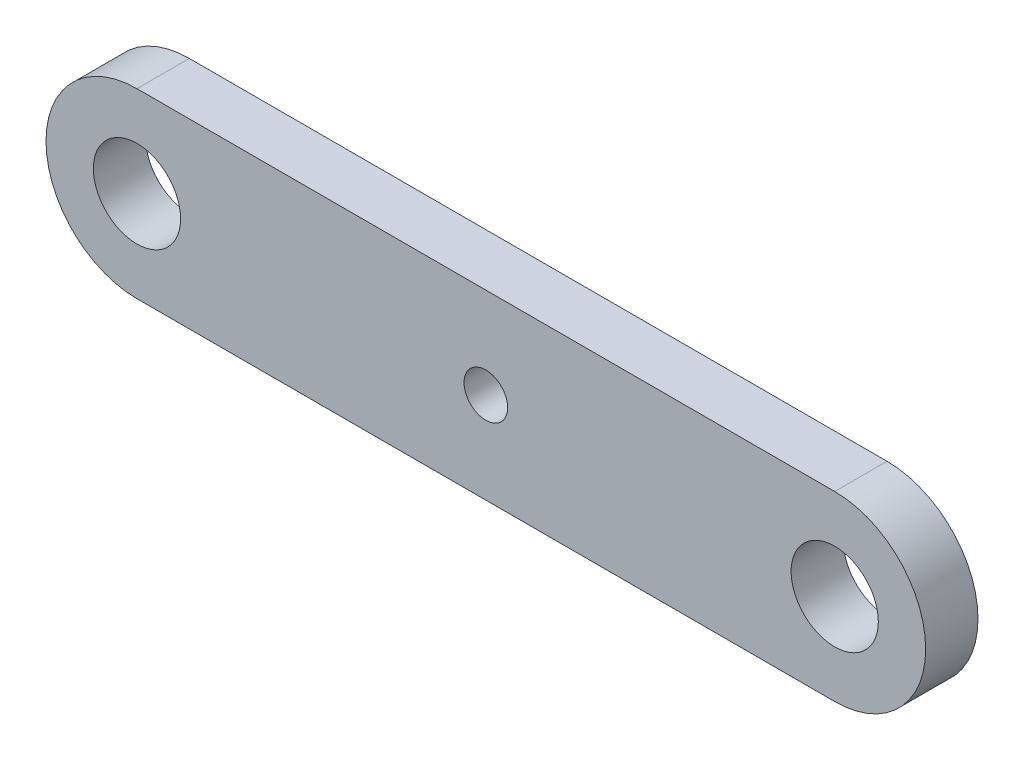
ISO-10303-21;
HEADER;
FILE_DESCRIPTION(('STEP AP214'),'2;1');
FILE_NAME('part.step','',(''),(''),'','','');
FILE_SCHEMA(('AUTOMOTIVE_DESIGN { 1 0 10303 214 1 1 1 1 }'));
ENDSEC;
DATA;
#1=APPLICATION_CONTEXT('core data for automotive mechanical design processes');
#2=APPLICATION_PROTOCOL_DEFINITION('international standard','automotive_design',2000,#1);
#3=PRODUCT_CONTEXT('',#1,'mechanical');
#4=PRODUCT('Part','Part','',(#3));
#5=PRODUCT_RELATED_PRODUCT_CATEGORY('part','',(#4));
#6=PRODUCT_DEFINITION_FORMATION('','',#4);
#7=PRODUCT_DEFINITION_CONTEXT('part definition',#1,'design');
#8=PRODUCT_DEFINITION('design','',#6,#7);
#9=PRODUCT_DEFINITION_SHAPE('','',#8);
#10=(LENGTH_UNIT() NAMED_UNIT(*) SI_UNIT(.MILLI.,.METRE.));
#11=(NAMED_UNIT(*) PLANE_ANGLE_UNIT() SI_UNIT($,.RADIAN.));
#12=(NAMED_UNIT(*) SI_UNIT($,.STERADIAN.) SOLID_ANGLE_UNIT());
#13=UNCERTAINTY_MEASURE_WITH_UNIT(LENGTH_MEASURE(1.E-05),#10,'distance_accuracy_value','');
#14=(GEOMETRIC_REPRESENTATION_CONTEXT(3) GLOBAL_UNCERTAINTY_ASSIGNED_CONTEXT((#13)) GLOBAL_UNIT_ASSIGNED_CONTEXT((#10,
#11,#12)) REPRESENTATION_CONTEXT('',''));
#15=CARTESIAN_POINT('',(0.,0.,0.));
#16=DIRECTION('',(0.,0.,1.));
#17=DIRECTION('',(1.,0.,0.));
#18=AXIS2_PLACEMENT_3D('',#15,#16,#17);
#19=CARTESIAN_POINT('',(-42.0369963296763,0.,6.));
#20=DIRECTION('',(0.,0.,1.));
#21=DIRECTION('',(1.,0.,0.));
#22=AXIS2_PLACEMENT_3D('',#19,#20,#21);
#23=PLANE('',#22);
#24=CARTESIAN_POINT('',(37.9630036703237,0.,6.));
#25=DIRECTION('',(0.,0.,1.));
#26=DIRECTION('',(1.,0.,0.));
#27=AXIS2_PLACEMENT_3D('',#24,#25,#26);
#28=CIRCLE('',#27,5.);
#29=CARTESIAN_POINT('',(42.9630036703237,0.,6.));
#30=VERTEX_POINT('',#29);
#31=EDGE_CURVE('E134',#30,#30,#28,.T.);
#32=ORIENTED_EDGE('',*,*,#31,.F.);
#33=EDGE_LOOP('',(#32));
#34=FACE_BOUND('',#33,.T.);
#35=CARTESIAN_POINT('',(-42.0369963296763,0.,6.));
#36=DIRECTION('',(0.,0.,1.));
#37=DIRECTION('',(1.,0.,0.));
#38=AXIS2_PLACEMENT_3D('',#35,#36,#37);
#39=CIRCLE('',#38,10.4294478527607);
#40=CARTESIAN_POINT('',(-42.0369963296763,10.4294478527607,6.));
#41=VERTEX_POINT('',#40);
#42=CARTESIAN_POINT('',(-42.0369963296763,-10.4294478527607,6.));
#43=VERTEX_POINT('',#42);
#44=EDGE_CURVE('E92',#41,#43,#39,.T.);
#45=ORIENTED_EDGE('',*,*,#44,.T.);
#46=DIRECTION('',(1.,0.,0.));
#47=VECTOR('',#46,1.);
#48=CARTESIAN_POINT('',(-42.0369963296763,-10.4294478527607,6.));
#49=LINE('',#48,#47);
#50=CARTESIAN_POINT('',(37.9630036703237,-10.4294478527607,6.));
#51=VERTEX_POINT('',#50);
#52=EDGE_CURVE('E87',#43,#51,#49,.T.);
#53=ORIENTED_EDGE('',*,*,#52,.T.);
#54=CARTESIAN_POINT('',(37.9630036703237,0.,6.));
#55=DIRECTION('',(0.,0.,1.));
#56=DIRECTION('',(1.,0.,0.));
#57=AXIS2_PLACEMENT_3D('',#54,#55,#56);
#58=CIRCLE('',#57,10.4294478527607);
#59=CARTESIAN_POINT('',(37.9630036703237,10.4294478527607,6.));
#60=VERTEX_POINT('',#59);
#61=EDGE_CURVE('E90',#51,#60,#58,.T.);
#62=ORIENTED_EDGE('',*,*,#61,.T.);
#63=DIRECTION('',(-1.,0.,0.));
#64=VECTOR('',#63,1.);
#65=CARTESIAN_POINT('',(-42.0369963296763,10.4294478527607,6.));
#66=LINE('',#65,#64);
#67=EDGE_CURVE('E57',#60,#41,#66,.T.);
#68=ORIENTED_EDGE('',*,*,#67,.T.);
#69=EDGE_LOOP('',(#45,#53,#62,#68));
#70=FACE_BOUND('',#69,.T.);
#71=CARTESIAN_POINT('',(-42.0369963296763,0.,6.));
#72=DIRECTION('',(0.,0.,1.));
#73=DIRECTION('',(1.,0.,0.));
#74=AXIS2_PLACEMENT_3D('',#71,#72,#73);
#75=CIRCLE('',#74,5.);
#76=CARTESIAN_POINT('',(-37.0369963296763,0.,6.));
#77=VERTEX_POINT('',#76);
#78=EDGE_CURVE('E112',#77,#77,#75,.T.);
#79=ORIENTED_EDGE('',*,*,#78,.F.);
#80=EDGE_LOOP('',(#79));
#81=FACE_BOUND('',#80,.T.);
#82=CARTESIAN_POINT('',(-2.03699632967632,0.,6.));
#83=DIRECTION('',(0.,0.,1.));
#84=DIRECTION('',(1.,0.,0.));
#85=AXIS2_PLACEMENT_3D('',#82,#83,#84);
#86=CIRCLE('',#85,2.5);
#87=CARTESIAN_POINT('',(0.463003670323679,0.,6.));
#88=VERTEX_POINT('',#87);
#89=EDGE_CURVE('E142',#88,#88,#86,.T.);
#90=ORIENTED_EDGE('',*,*,#89,.F.);
#91=EDGE_LOOP('',(#90));
#92=FACE_BOUND('',#91,.T.);
#93=ADVANCED_FACE('F39',(#34,#70,#81,#92),#23,.T.);
#94=CARTESIAN_POINT('',(-42.0369963296763,0.,0.));
#95=DIRECTION('',(0.,0.,1.));
#96=DIRECTION('',(1.,0.,0.));
#97=AXIS2_PLACEMENT_3D('',#94,#95,#96);
#98=PLANE('',#97);
#99=CARTESIAN_POINT('',(-42.0369963296763,0.,0.));
#100=DIRECTION('',(0.,0.,1.));
#101=DIRECTION('',(1.,0.,0.));
#102=AXIS2_PLACEMENT_3D('',#99,#100,#101);
#103=CIRCLE('',#102,10.4294478527607);
#104=CARTESIAN_POINT('',(-42.0369963296763,10.4294478527607,0.));
#105=VERTEX_POINT('',#104);
#106=CARTESIAN_POINT('',(-42.0369963296763,-10.4294478527607,0.));
#107=VERTEX_POINT('',#106);
#108=EDGE_CURVE('E108',#105,#107,#103,.T.);
#109=ORIENTED_EDGE('',*,*,#108,.F.);
#110=DIRECTION('',(-1.,0.,0.));
#111=VECTOR('',#110,1.);
#112=CARTESIAN_POINT('',(-42.0369963296763,10.4294478527607,0.));
#113=LINE('',#112,#111);
#114=CARTESIAN_POINT('',(37.9630036703237,10.4294478527607,0.));
#115=VERTEX_POINT('',#114);
#116=EDGE_CURVE('E80',#115,#105,#113,.T.);
#117=ORIENTED_EDGE('',*,*,#116,.F.);
#118=CARTESIAN_POINT('',(37.9630036703237,0.,0.));
#119=DIRECTION('',(0.,0.,1.));
#120=DIRECTION('',(1.,0.,0.));
#121=AXIS2_PLACEMENT_3D('',#118,#119,#120);
#122=CIRCLE('',#121,10.4294478527607);
#123=CARTESIAN_POINT('',(37.9630036703237,-10.4294478527607,0.));
#124=VERTEX_POINT('',#123);
#125=EDGE_CURVE('E74',#124,#115,#122,.T.);
#126=ORIENTED_EDGE('',*,*,#125,.F.);
#127=DIRECTION('',(1.,0.,0.));
#128=VECTOR('',#127,1.);
#129=CARTESIAN_POINT('',(-42.0369963296763,-10.4294478527607,0.));
#130=LINE('',#129,#128);
#131=EDGE_CURVE('E97',#107,#124,#130,.T.);
#132=ORIENTED_EDGE('',*,*,#131,.F.);
#133=EDGE_LOOP('',(#109,#117,#126,#132));
#134=FACE_BOUND('',#133,.T.);
#135=CARTESIAN_POINT('',(-42.0369963296763,0.,0.));
#136=DIRECTION('',(0.,0.,1.));
#137=DIRECTION('',(1.,0.,0.));
#138=AXIS2_PLACEMENT_3D('',#135,#136,#137);
#139=CIRCLE('',#138,5.);
#140=CARTESIAN_POINT('',(-37.0369963296763,0.,0.));
#141=VERTEX_POINT('',#140);
#142=EDGE_CURVE('E130',#141,#141,#139,.T.);
#143=ORIENTED_EDGE('',*,*,#142,.T.);
#144=EDGE_LOOP('',(#143));
#145=FACE_BOUND('',#144,.T.);
#146=CARTESIAN_POINT('',(37.9630036703237,0.,0.));
#147=DIRECTION('',(0.,0.,1.));
#148=DIRECTION('',(1.,0.,0.));
#149=AXIS2_PLACEMENT_3D('',#146,#147,#148);
#150=CIRCLE('',#149,5.);
#151=CARTESIAN_POINT('',(42.9630036703237,0.,0.));
#152=VERTEX_POINT('',#151);
#153=EDGE_CURVE('E138',#152,#152,#150,.T.);
#154=ORIENTED_EDGE('',*,*,#153,.T.);
#155=EDGE_LOOP('',(#154));
#156=FACE_BOUND('',#155,.T.);
#157=CARTESIAN_POINT('',(-2.03699632967632,0.,0.));
#158=DIRECTION('',(0.,0.,1.));
#159=DIRECTION('',(1.,0.,0.));
#160=AXIS2_PLACEMENT_3D('',#157,#158,#159);
#161=CIRCLE('',#160,2.5);
#162=CARTESIAN_POINT('',(0.463003670323679,0.,0.));
#163=VERTEX_POINT('',#162);
#164=EDGE_CURVE('E146',#163,#163,#161,.T.);
#165=ORIENTED_EDGE('',*,*,#164,.T.);
#166=EDGE_LOOP('',(#165));
#167=FACE_BOUND('',#166,.T.);
#168=ADVANCED_FACE('F125',(#134,#145,#156,#167),#98,.F.);
#169=CARTESIAN_POINT('',(-42.0369963296763,0.,6.));
#170=DIRECTION('',(0.,0.,-1.));
#171=DIRECTION('',(-1.,0.,0.));
#172=AXIS2_PLACEMENT_3D('',#169,#170,#171);
#173=CYLINDRICAL_SURFACE('',#172,10.4294478527607);
#174=ORIENTED_EDGE('',*,*,#108,.T.);
#175=DIRECTION('',(0.,0.,-1.));
#176=VECTOR('',#175,1.);
#177=CARTESIAN_POINT('',(-42.0369963296763,-10.4294478527607,6.));
#178=LINE('',#177,#176);
#179=EDGE_CURVE('E11',#43,#107,#178,.T.);
#180=ORIENTED_EDGE('',*,*,#179,.F.);
#181=ORIENTED_EDGE('',*,*,#44,.F.);
#182=DIRECTION('',(0.,0.,-1.));
#183=VECTOR('',#182,1.);
#184=CARTESIAN_POINT('',(-42.0369963296763,10.4294478527607,6.));
#185=LINE('',#184,#183);
#186=EDGE_CURVE('E104',#41,#105,#185,.T.);
#187=ORIENTED_EDGE('',*,*,#186,.T.);
#188=EDGE_LOOP('',(#174,#180,#181,#187));
#189=FACE_BOUND('',#188,.T.);
#190=ADVANCED_FACE('F41',(#189),#173,.T.);
#191=CARTESIAN_POINT('',(-42.0369963296763,-10.4294478527607,6.));
#192=DIRECTION('',(0.,1.,0.));
#193=DIRECTION('',(0.,0.,1.));
#194=AXIS2_PLACEMENT_3D('',#191,#192,#193);
#195=PLANE('',#194);
#196=ORIENTED_EDGE('',*,*,#131,.T.);
#197=DIRECTION('',(0.,0.,-1.));
#198=VECTOR('',#197,1.);
#199=CARTESIAN_POINT('',(37.9630036703237,-10.4294478527607,6.));
#200=LINE('',#199,#198);
#201=EDGE_CURVE('E49',#51,#124,#200,.T.);
#202=ORIENTED_EDGE('',*,*,#201,.F.);
#203=ORIENTED_EDGE('',*,*,#52,.F.);
#204=ORIENTED_EDGE('',*,*,#179,.T.);
#205=EDGE_LOOP('',(#196,#202,#203,#204));
#206=FACE_BOUND('',#205,.T.);
#207=ADVANCED_FACE('F96',(#206),#195,.F.);
#208=CARTESIAN_POINT('',(37.9630036703237,0.,6.));
#209=DIRECTION('',(0.,0.,-1.));
#210=DIRECTION('',(-1.,0.,0.));
#211=AXIS2_PLACEMENT_3D('',#208,#209,#210);
#212=CYLINDRICAL_SURFACE('',#211,10.4294478527607);
#213=ORIENTED_EDGE('',*,*,#125,.T.);
#214=DIRECTION('',(0.,0.,-1.));
#215=VECTOR('',#214,1.);
#216=CARTESIAN_POINT('',(37.9630036703237,10.4294478527607,6.));
#217=LINE('',#216,#215);
#218=EDGE_CURVE('E99',#60,#115,#217,.T.);
#219=ORIENTED_EDGE('',*,*,#218,.F.);
#220=ORIENTED_EDGE('',*,*,#61,.F.);
#221=ORIENTED_EDGE('',*,*,#201,.T.);
#222=EDGE_LOOP('',(#213,#219,#220,#221));
#223=FACE_BOUND('',#222,.T.);
#224=ADVANCED_FACE('F100',(#223),#212,.T.);
#225=CARTESIAN_POINT('',(-42.0369963296763,10.4294478527607,6.));
#226=DIRECTION('',(0.,-1.,0.));
#227=DIRECTION('',(0.,0.,-1.));
#228=AXIS2_PLACEMENT_3D('',#225,#226,#227);
#229=PLANE('',#228);
#230=ORIENTED_EDGE('',*,*,#116,.T.);
#231=ORIENTED_EDGE('',*,*,#186,.F.);
#232=ORIENTED_EDGE('',*,*,#67,.F.);
#233=ORIENTED_EDGE('',*,*,#218,.T.);
#234=EDGE_LOOP('',(#230,#231,#232,#233));
#235=FACE_BOUND('',#234,.T.);
#236=ADVANCED_FACE('F122',(#235),#229,.F.);
#237=CARTESIAN_POINT('',(-42.0369963296763,0.,6.));
#238=DIRECTION('',(0.,0.,-1.));
#239=DIRECTION('',(-1.,0.,0.));
#240=AXIS2_PLACEMENT_3D('',#237,#238,#239);
#241=CYLINDRICAL_SURFACE('',#240,5.);
#242=ORIENTED_EDGE('',*,*,#78,.T.);
#243=EDGE_LOOP('',(#242));
#244=FACE_BOUND('',#243,.T.);
#245=ORIENTED_EDGE('',*,*,#142,.F.);
#246=EDGE_LOOP('',(#245));
#247=FACE_BOUND('',#246,.T.);
#248=ADVANCED_FACE('F166',(#244,#247),#241,.F.);
#249=CARTESIAN_POINT('',(37.9630036703237,0.,6.));
#250=DIRECTION('',(0.,0.,-1.));
#251=DIRECTION('',(-1.,0.,0.));
#252=AXIS2_PLACEMENT_3D('',#249,#250,#251);
#253=CYLINDRICAL_SURFACE('',#252,5.);
#254=ORIENTED_EDGE('',*,*,#31,.T.);
#255=EDGE_LOOP('',(#254));
#256=FACE_BOUND('',#255,.T.);
#257=ORIENTED_EDGE('',*,*,#153,.F.);
#258=EDGE_LOOP('',(#257));
#259=FACE_BOUND('',#258,.T.);
#260=ADVANCED_FACE('F212',(#256,#259),#253,.F.);
#261=CARTESIAN_POINT('',(-2.03699632967632,0.,6.));
#262=DIRECTION('',(0.,0.,-1.));
#263=DIRECTION('',(-1.,0.,0.));
#264=AXIS2_PLACEMENT_3D('',#261,#262,#263);
#265=CYLINDRICAL_SURFACE('',#264,2.5);
#266=ORIENTED_EDGE('',*,*,#89,.T.);
#267=EDGE_LOOP('',(#266));
#268=FACE_BOUND('',#267,.T.);
#269=ORIENTED_EDGE('',*,*,#164,.F.);
#270=EDGE_LOOP('',(#269));
#271=FACE_BOUND('',#270,.T.);
#272=ADVANCED_FACE('F154',(#268,#271),#265,.F.);
#273=CLOSED_SHELL('',(#93,#168,#190,#207,#224,#236,#248,#260,#272));
#274=MANIFOLD_SOLID_BREP('B2',#273);
#275=ADVANCED_BREP_SHAPE_REPRESENTATION('',(#18,#274),#14);
#276=SHAPE_DEFINITION_REPRESENTATION(#9,#275);
ENDSEC;
END-ISO-10303-21;
